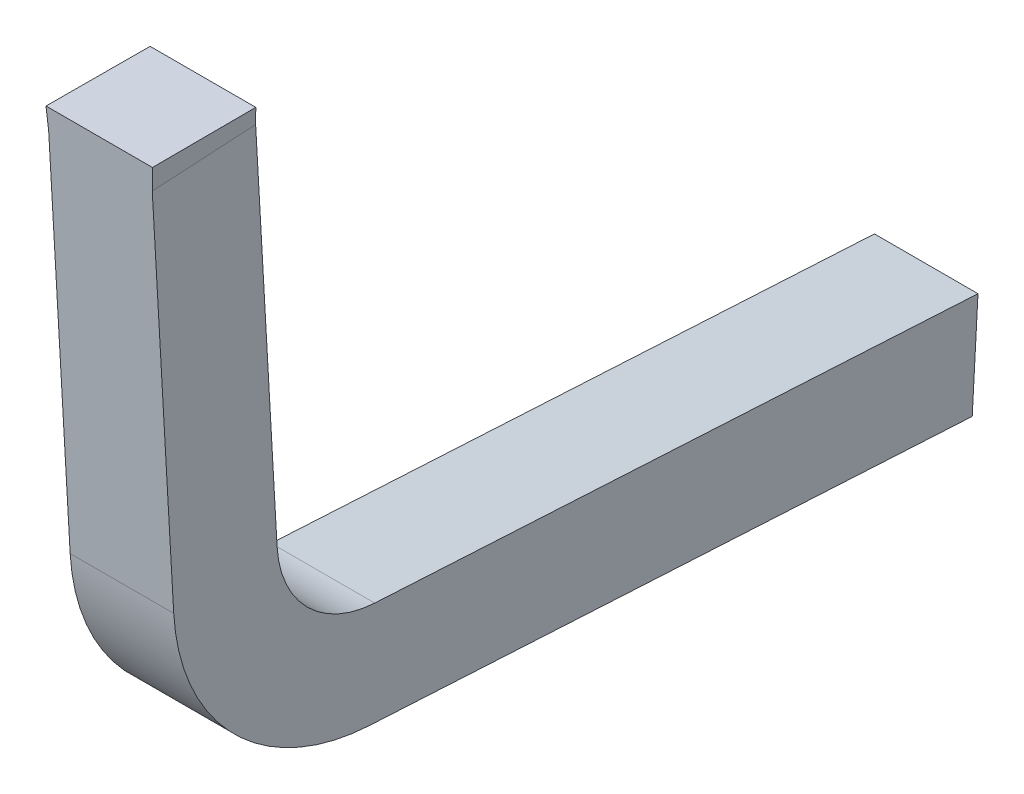
ISO-10303-21;
HEADER;
FILE_DESCRIPTION(('STEP AP214'),'2;1');
FILE_NAME('part.step','',(''),(''),'','','');
FILE_SCHEMA(('AUTOMOTIVE_DESIGN { 1 0 10303 214 1 1 1 1 }'));
ENDSEC;
DATA;
#1=APPLICATION_CONTEXT('core data for automotive mechanical design processes');
#2=APPLICATION_PROTOCOL_DEFINITION('international standard','automotive_design',2000,#1);
#3=PRODUCT_CONTEXT('',#1,'mechanical');
#4=PRODUCT('Part','Part','',(#3));
#5=PRODUCT_RELATED_PRODUCT_CATEGORY('part','',(#4));
#6=PRODUCT_DEFINITION_FORMATION('','',#4);
#7=PRODUCT_DEFINITION_CONTEXT('part definition',#1,'design');
#8=PRODUCT_DEFINITION('design','',#6,#7);
#9=PRODUCT_DEFINITION_SHAPE('','',#8);
#10=(LENGTH_UNIT() NAMED_UNIT(*) SI_UNIT(.MILLI.,.METRE.));
#11=(NAMED_UNIT(*) PLANE_ANGLE_UNIT() SI_UNIT($,.RADIAN.));
#12=(NAMED_UNIT(*) SI_UNIT($,.STERADIAN.) SOLID_ANGLE_UNIT());
#13=UNCERTAINTY_MEASURE_WITH_UNIT(LENGTH_MEASURE(1.E-05),#10,'distance_accuracy_value','');
#14=(GEOMETRIC_REPRESENTATION_CONTEXT(3) GLOBAL_UNCERTAINTY_ASSIGNED_CONTEXT((#13)) GLOBAL_UNIT_ASSIGNED_CONTEXT((#10,
#11,#12)) REPRESENTATION_CONTEXT('',''));
#15=CARTESIAN_POINT('',(0.,0.,0.));
#16=DIRECTION('',(0.,0.,1.));
#17=DIRECTION('',(1.,0.,0.));
#18=AXIS2_PLACEMENT_3D('',#15,#16,#17);
#19=CARTESIAN_POINT('',(0.3985931658174,-2.29897527843,-10.34781984343));
#20=DIRECTION('',(0.99778515785658,0.0664110879142587,0.00378763292365092));
#21=DIRECTION('',(-0.0664115642915359,0.997792315127928,0.));
#22=AXIS2_PLACEMENT_3D('',#19,#20,#21);
#23=PLANE('',#22);
#24=DIRECTION('',(0.,-0.0569406083110753,0.998377567418842));
#25=VECTOR('',#24,1.);
#26=CARTESIAN_POINT('',(0.4,-2.314349492935,-10.44885919008));
#27=LINE('',#26,#25);
#28=CARTESIAN_POINT('',(0.4,-2.31434949293492,-10.4488591900814));
#29=VERTEX_POINT('',#28);
#30=CARTESIAN_POINT('',(0.4,-2.32573761459727,-10.2491836765951));
#31=VERTEX_POINT('',#30);
#32=EDGE_CURVE('E98',#29,#31,#27,.T.);
#33=ORIENTED_EDGE('',*,*,#32,.T.);
#34=DIRECTION('',(0.0665190105194852,-0.996166318707669,-0.0568144938542911));
#35=VECTOR('',#34,1.);
#36=CARTESIAN_POINT('',(0.3971863316348,-2.28360106392498,-10.2467804967704));
#37=LINE('',#36,#35);
#38=CARTESIAN_POINT('',(0.3971863316348,-2.28360106392499,-10.2467804967704));
#39=VERTEX_POINT('',#38);
#40=EDGE_CURVE('E148',#39,#31,#37,.T.);
#41=ORIENTED_EDGE('',*,*,#40,.F.);
#42=DIRECTION('',(-0.003796013203572,0.,0.999992795115924));
#43=VECTOR('',#42,1.);
#44=CARTESIAN_POINT('',(0.3979467735112,-2.283601063925,-10.4471055106));
#45=LINE('',#44,#43);
#46=CARTESIAN_POINT('',(0.3979467735112,-2.28360106392489,-10.4471055106019));
#47=VERTEX_POINT('',#46);
#48=EDGE_CURVE('E161',#47,#39,#45,.T.);
#49=ORIENTED_EDGE('',*,*,#48,.F.);
#50=DIRECTION('',(0.0665190105209171,-0.996166318707655,-0.0568144938528551));
#51=VECTOR('',#50,1.);
#52=CARTESIAN_POINT('',(0.3979467735112,-2.28360106392483,-10.4471055106029));
#53=LINE('',#52,#51);
#54=EDGE_CURVE('E103',#47,#29,#53,.T.);
#55=ORIENTED_EDGE('',*,*,#54,.T.);
#56=EDGE_LOOP('',(#33,#41,#49,#55));
#57=FACE_BOUND('',#56,.T.);
#58=ADVANCED_FACE('F17',(#57),#23,.F.);
#59=CARTESIAN_POINT('',(0.5,-2.283601063925,-10.34694300369));
#60=DIRECTION('',(0.,1.,0.));
#61=DIRECTION('',(0.,0.,1.));
#62=AXIS2_PLACEMENT_3D('',#59,#60,#61);
#63=PLANE('',#62);
#64=DIRECTION('',(1.,0.,0.));
#65=VECTOR('',#64,1.);
#66=CARTESIAN_POINT('',(0.4999999999999,-2.28360106392498,-10.2467804967704));
#67=LINE('',#66,#65);
#68=CARTESIAN_POINT('',(0.602813668365201,-2.28360106392499,-10.2467804967704));
#69=VERTEX_POINT('',#68);
#70=EDGE_CURVE('E154',#69,#39,#67,.F.);
#71=ORIENTED_EDGE('',*,*,#70,.F.);
#72=DIRECTION('',(0.00379601320391404,0.,0.999992795115923));
#73=VECTOR('',#72,1.);
#74=CARTESIAN_POINT('',(0.602053226488737,-2.283601063925,-10.4471055106));
#75=LINE('',#74,#73);
#76=CARTESIAN_POINT('',(0.602053226488724,-2.28360106392495,-10.447105510601));
#77=VERTEX_POINT('',#76);
#78=EDGE_CURVE('E119',#77,#69,#75,.T.);
#79=ORIENTED_EDGE('',*,*,#78,.F.);
#80=DIRECTION('',(1.,0.,0.));
#81=VECTOR('',#80,1.);
#82=CARTESIAN_POINT('',(0.4999999999999,-2.28360106392483,-10.4471055106029));
#83=LINE('',#82,#81);
#84=EDGE_CURVE('E125',#77,#47,#83,.F.);
#85=ORIENTED_EDGE('',*,*,#84,.T.);
#86=ORIENTED_EDGE('',*,*,#48,.T.);
#87=EDGE_LOOP('',(#71,#79,#85,#86));
#88=FACE_BOUND('',#87,.T.);
#89=ADVANCED_FACE('F243',(#88),#63,.T.);
#90=CARTESIAN_POINT('',(0.4,-2.909472777839,-11.05227927458));
#91=DIRECTION('',(1.,0.,0.));
#92=DIRECTION('',(0.,0.,-1.));
#93=AXIS2_PLACEMENT_3D('',#90,#91,#92);
#94=PLANE('',#93);
#95=CARTESIAN_POINT('',(0.4,-3.03,-10.69));
#96=DIRECTION('',(-1.,0.,0.));
#97=DIRECTION('',(0.,0.,1.));
#98=AXIS2_PLACEMENT_3D('',#95,#96,#97);
#99=CIRCLE('',#98,0.4);
#100=CARTESIAN_POINT('',(0.4,-3.05277624331319,-10.2906489730306));
#101=VERTEX_POINT('',#100);
#102=CARTESIAN_POINT('',(0.4,-3.42937693582933,-10.6676826720305));
#103=VERTEX_POINT('',#102);
#104=EDGE_CURVE('E142',#101,#103,#99,.F.);
#105=ORIENTED_EDGE('',*,*,#104,.F.);
#106=DIRECTION('',(0.,-0.998377567418718,-0.056940608313261));
#107=VECTOR('',#106,1.);
#108=CARTESIAN_POINT('',(0.4,-2.668188653621,-10.2687147349));
#109=LINE('',#108,#107);
#110=EDGE_CURVE('E145',#31,#101,#109,.T.);
#111=ORIENTED_EDGE('',*,*,#110,.F.);
#112=ORIENTED_EDGE('',*,*,#32,.F.);
#113=DIRECTION('',(0.,-0.998377567418801,-0.0569406083117901));
#114=VECTOR('',#113,1.);
#115=CARTESIAN_POINT('',(0.4,-2.662494592804,-10.46871499856));
#116=LINE('',#115,#114);
#117=CARTESIAN_POINT('',(0.4,-3.04138812167726,-10.4903244865168));
#118=VERTEX_POINT('',#117);
#119=EDGE_CURVE('E92',#29,#118,#116,.T.);
#120=ORIENTED_EDGE('',*,*,#119,.T.);
#121=CARTESIAN_POINT('',(0.4,-3.03,-10.69));
#122=DIRECTION('',(-1.,0.,0.));
#123=DIRECTION('',(0.,0.,1.));
#124=AXIS2_PLACEMENT_3D('',#121,#122,#123);
#125=CIRCLE('',#124,0.2);
#126=CARTESIAN_POINT('',(0.4,-3.22968846791482,-10.6788413360177));
#127=VERTEX_POINT('',#126);
#128=EDGE_CURVE('E20',#118,#127,#125,.F.);
#129=ORIENTED_EDGE('',*,*,#128,.T.);
#130=DIRECTION('',(0.,0.0557933199228295,0.998442339572991));
#131=VECTOR('',#130,1.);
#132=CARTESIAN_POINT('',(0.4,-3.262244863925,-11.26145022621));
#133=LINE('',#132,#131);
#134=CARTESIAN_POINT('',(0.4,-3.29480125993501,-11.8440591164004));
#135=VERTEX_POINT('',#134);
#136=EDGE_CURVE('E111',#135,#127,#133,.T.);
#137=ORIENTED_EDGE('',*,*,#136,.F.);
#138=DIRECTION('',(0.,-0.998442339574031,0.0557933199042218));
#139=VECTOR('',#138,1.);
#140=CARTESIAN_POINT('',(0.4,-3.394645493892,-11.83847978441));
#141=LINE('',#140,#139);
#142=CARTESIAN_POINT('',(0.4,-3.49448972784906,-11.8329004524196));
#143=VERTEX_POINT('',#142);
#144=EDGE_CURVE('E135',#135,#143,#141,.T.);
#145=ORIENTED_EDGE('',*,*,#144,.T.);
#146=DIRECTION('',(0.,0.055793319922371,0.998442339573017));
#147=VECTOR('',#146,1.);
#148=CARTESIAN_POINT('',(0.4,-3.461933331839,-11.25029156222));
#149=LINE('',#148,#147);
#150=EDGE_CURVE('E140',#143,#103,#149,.T.);
#151=ORIENTED_EDGE('',*,*,#150,.T.);
#152=EDGE_LOOP('',(#105,#111,#112,#120,#129,#137,#145,#151));
#153=FACE_BOUND('',#152,.T.);
#154=ADVANCED_FACE('F95',(#153),#94,.F.);
#155=CARTESIAN_POINT('',(0.5,-3.262244863925,-11.26145022621));
#156=DIRECTION('',(0.,0.998442339572991,-0.0557933199228295));
#157=DIRECTION('',(0.,0.0557933199228295,0.998442339572991));
#158=AXIS2_PLACEMENT_3D('',#155,#156,#157);
#159=PLANE('',#158);
#160=DIRECTION('',(0.,0.055793319922887,0.998442339572988));
#161=VECTOR('',#160,1.);
#162=CARTESIAN_POINT('',(0.6,-3.294801259935,-11.8440591164));
#163=LINE('',#162,#161);
#164=CARTESIAN_POINT('',(0.6,-3.29480125993501,-11.8440591164001));
#165=VERTEX_POINT('',#164);
#166=CARTESIAN_POINT('',(0.6,-3.2296884679148,-10.6788413360177));
#167=VERTEX_POINT('',#166);
#168=EDGE_CURVE('E129',#165,#167,#163,.T.);
#169=ORIENTED_EDGE('',*,*,#168,.F.);
#170=DIRECTION('',(1.,0.,0.));
#171=VECTOR('',#170,1.);
#172=CARTESIAN_POINT('',(0.5,-3.29480125993502,-11.8440591164004));
#173=LINE('',#172,#171);
#174=EDGE_CURVE('E126',#165,#135,#173,.F.);
#175=ORIENTED_EDGE('',*,*,#174,.T.);
#176=ORIENTED_EDGE('',*,*,#136,.T.);
#177=DIRECTION('',(-1.,0.,0.));
#178=VECTOR('',#177,1.);
#179=CARTESIAN_POINT('',(0.604,-3.22968846791485,-10.67884133602));
#180=LINE('',#179,#178);
#181=EDGE_CURVE('E110',#127,#167,#180,.F.);
#182=ORIENTED_EDGE('',*,*,#181,.T.);
#183=EDGE_LOOP('',(#169,#175,#176,#182));
#184=FACE_BOUND('',#183,.T.);
#185=ADVANCED_FACE('F234',(#184),#159,.T.);
#186=CARTESIAN_POINT('',(0.604,-3.03,-10.69));
#187=DIRECTION('',(-1.,0.,0.));
#188=DIRECTION('',(0.,0.,1.));
#189=AXIS2_PLACEMENT_3D('',#186,#187,#188);
#190=CYLINDRICAL_SURFACE('',#189,0.2);
#191=ORIENTED_EDGE('',*,*,#128,.F.);
#192=DIRECTION('',(1.,0.,0.));
#193=VECTOR('',#192,1.);
#194=CARTESIAN_POINT('',(0.4999999999999,-3.04138812169214,-10.4903244865176));
#195=LINE('',#194,#193);
#196=CARTESIAN_POINT('',(0.6,-3.04138812167779,-10.490324486518));
#197=VERTEX_POINT('',#196);
#198=EDGE_CURVE('E102',#118,#197,#195,.T.);
#199=ORIENTED_EDGE('',*,*,#198,.T.);
#200=CARTESIAN_POINT('',(0.6,-3.03,-10.69));
#201=DIRECTION('',(-1.,0.,0.));
#202=DIRECTION('',(0.,0.,1.));
#203=AXIS2_PLACEMENT_3D('',#200,#201,#202);
#204=CIRCLE('',#203,0.2);
#205=EDGE_CURVE('E185',#167,#197,#204,.T.);
#206=ORIENTED_EDGE('',*,*,#205,.F.);
#207=ORIENTED_EDGE('',*,*,#181,.F.);
#208=EDGE_LOOP('',(#191,#199,#206,#207));
#209=FACE_BOUND('',#208,.T.);
#210=ADVANCED_FACE('F107',(#209),#190,.F.);
#211=CARTESIAN_POINT('',(0.4999999999999,-2.662494592804,-10.46871499856));
#212=DIRECTION('',(0.,-0.0569406083117901,0.998377567418801));
#213=DIRECTION('',(0.,-0.998377567418801,-0.0569406083117901));
#214=AXIS2_PLACEMENT_3D('',#211,#212,#213);
#215=PLANE('',#214);
#216=DIRECTION('',(0.,0.998377567418456,0.0569406083178453));
#217=VECTOR('',#216,1.);
#218=CARTESIAN_POINT('',(0.6,-3.041388121692,-10.49032448652));
#219=LINE('',#218,#217);
#220=CARTESIAN_POINT('',(0.599999999999989,-2.314349492934,-10.44885919008));
#221=VERTEX_POINT('',#220);
#222=EDGE_CURVE('E114',#197,#221,#219,.T.);
#223=ORIENTED_EDGE('',*,*,#222,.F.);
#224=ORIENTED_EDGE('',*,*,#198,.F.);
#225=ORIENTED_EDGE('',*,*,#119,.F.);
#226=ORIENTED_EDGE('',*,*,#54,.F.);
#227=ORIENTED_EDGE('',*,*,#84,.F.);
#228=DIRECTION('',(0.0665190105221076,0.99616631870597,0.0568144938810031));
#229=VECTOR('',#228,1.);
#230=CARTESIAN_POINT('',(0.599999999999967,-2.314349492934,-10.44885919008));
#231=LINE('',#230,#229);
#232=EDGE_CURVE('E116',#221,#77,#231,.T.);
#233=ORIENTED_EDGE('',*,*,#232,.F.);
#234=EDGE_LOOP('',(#223,#224,#225,#226,#227,#233));
#235=FACE_BOUND('',#234,.T.);
#236=ADVANCED_FACE('F112',(#235),#215,.F.);
#237=CARTESIAN_POINT('',(0.6014068341826,-2.298975278429,-10.34781984343));
#238=DIRECTION('',(0.99778515785672,-0.0664110879121713,-0.00378763292334907));
#239=DIRECTION('',(0.0664115642894485,0.997792315128067,0.));
#240=AXIS2_PLACEMENT_3D('',#237,#238,#239);
#241=PLANE('',#240);
#242=ORIENTED_EDGE('',*,*,#232,.T.);
#243=ORIENTED_EDGE('',*,*,#78,.T.);
#244=DIRECTION('',(0.0665190105226197,0.996166318707459,0.0568144938543015));
#245=VECTOR('',#244,1.);
#246=CARTESIAN_POINT('',(0.6,-2.32573761459528,-10.249183676595));
#247=LINE('',#246,#245);
#248=CARTESIAN_POINT('',(0.6,-2.32573761459509,-10.2491836765983));
#249=VERTEX_POINT('',#248);
#250=EDGE_CURVE('E147',#249,#69,#247,.T.);
#251=ORIENTED_EDGE('',*,*,#250,.F.);
#252=DIRECTION('',(0.,-0.0569406083060912,0.998377567419126));
#253=VECTOR('',#252,1.);
#254=CARTESIAN_POINT('',(0.6,-2.314349492934,-10.44885919008));
#255=LINE('',#254,#253);
#256=EDGE_CURVE('E200',#221,#249,#255,.T.);
#257=ORIENTED_EDGE('',*,*,#256,.F.);
#258=EDGE_LOOP('',(#242,#243,#251,#257));
#259=FACE_BOUND('',#258,.T.);
#260=ADVANCED_FACE('F258',(#259),#241,.T.);
#261=CARTESIAN_POINT('',(0.4999999999999,-2.668188653621,-10.2687147349));
#262=DIRECTION('',(0.,-0.056940608313261,0.998377567418718));
#263=DIRECTION('',(0.,-0.998377567418718,-0.056940608313261));
#264=AXIS2_PLACEMENT_3D('',#261,#262,#263);
#265=PLANE('',#264);
#266=ORIENTED_EDGE('',*,*,#250,.T.);
#267=ORIENTED_EDGE('',*,*,#70,.T.);
#268=ORIENTED_EDGE('',*,*,#40,.T.);
#269=ORIENTED_EDGE('',*,*,#110,.T.);
#270=DIRECTION('',(-1.,0.,0.));
#271=VECTOR('',#270,1.);
#272=CARTESIAN_POINT('',(0.604,-3.05277624330094,-10.2906489730311));
#273=LINE('',#272,#271);
#274=CARTESIAN_POINT('',(0.6,-3.05277624331214,-10.2906489730312));
#275=VERTEX_POINT('',#274);
#276=EDGE_CURVE('E157',#275,#101,#273,.T.);
#277=ORIENTED_EDGE('',*,*,#276,.F.);
#278=DIRECTION('',(0.,-0.998377567419005,-0.0569406083082185));
#279=VECTOR('',#278,1.);
#280=CARTESIAN_POINT('',(0.6,-2.325737614595,-10.2491836766));
#281=LINE('',#280,#279);
#282=EDGE_CURVE('E184',#249,#275,#281,.T.);
#283=ORIENTED_EDGE('',*,*,#282,.F.);
#284=EDGE_LOOP('',(#266,#267,#268,#269,#277,#283));
#285=FACE_BOUND('',#284,.T.);
#286=ADVANCED_FACE('F227',(#285),#265,.T.);
#287=CARTESIAN_POINT('',(0.604,-3.03,-10.69));
#288=DIRECTION('',(-1.,0.,0.));
#289=DIRECTION('',(0.,0.,1.));
#290=AXIS2_PLACEMENT_3D('',#287,#288,#289);
#291=CYLINDRICAL_SURFACE('',#290,0.4);
#292=DIRECTION('',(1.,0.,0.));
#293=VECTOR('',#292,1.);
#294=CARTESIAN_POINT('',(0.5,-3.4293769358293,-10.66768267203));
#295=LINE('',#294,#293);
#296=CARTESIAN_POINT('',(0.6,-3.42937693582946,-10.6676826720306));
#297=VERTEX_POINT('',#296);
#298=EDGE_CURVE('E137',#103,#297,#295,.T.);
#299=ORIENTED_EDGE('',*,*,#298,.T.);
#300=CARTESIAN_POINT('',(0.6,-3.03,-10.69));
#301=DIRECTION('',(-1.,0.,0.));
#302=DIRECTION('',(0.,0.,1.));
#303=AXIS2_PLACEMENT_3D('',#300,#301,#302);
#304=CIRCLE('',#303,0.4);
#305=EDGE_CURVE('E181',#275,#297,#304,.F.);
#306=ORIENTED_EDGE('',*,*,#305,.F.);
#307=ORIENTED_EDGE('',*,*,#276,.T.);
#308=ORIENTED_EDGE('',*,*,#104,.T.);
#309=EDGE_LOOP('',(#299,#306,#307,#308));
#310=FACE_BOUND('',#309,.T.);
#311=ADVANCED_FACE('F220',(#310),#291,.T.);
#312=CARTESIAN_POINT('',(0.5,-3.461933331839,-11.25029156222));
#313=DIRECTION('',(0.,0.998442339573017,-0.055793319922371));
#314=DIRECTION('',(0.,0.055793319922371,0.998442339573017));
#315=AXIS2_PLACEMENT_3D('',#312,#313,#314);
#316=PLANE('',#315);
#317=ORIENTED_EDGE('',*,*,#298,.F.);
#318=ORIENTED_EDGE('',*,*,#150,.F.);
#319=DIRECTION('',(1.,0.,0.));
#320=VECTOR('',#319,1.);
#321=CARTESIAN_POINT('',(0.5,-3.49448972784898,-11.8329004524196));
#322=LINE('',#321,#320);
#323=CARTESIAN_POINT('',(0.6,-3.49448972784899,-11.8329004524199));
#324=VERTEX_POINT('',#323);
#325=EDGE_CURVE('E35',#143,#324,#322,.T.);
#326=ORIENTED_EDGE('',*,*,#325,.T.);
#327=DIRECTION('',(0.,-0.0557933199219327,-0.998442339573042));
#328=VECTOR('',#327,1.);
#329=CARTESIAN_POINT('',(0.6,-3.429376935829,-10.66768267202));
#330=LINE('',#329,#328);
#331=EDGE_CURVE('E26',#297,#324,#330,.T.);
#332=ORIENTED_EDGE('',*,*,#331,.F.);
#333=EDGE_LOOP('',(#317,#318,#326,#332));
#334=FACE_BOUND('',#333,.T.);
#335=ADVANCED_FACE('F222',(#334),#316,.F.);
#336=CARTESIAN_POINT('',(0.5,-3.394645493892,-11.83847978441));
#337=DIRECTION('',(0.,0.0557933199042218,0.998442339574031));
#338=DIRECTION('',(0.,-0.998442339574031,0.0557933199042218));
#339=AXIS2_PLACEMENT_3D('',#336,#337,#338);
#340=PLANE('',#339);
#341=DIRECTION('',(0.,0.998442339574254,-0.0557933199002383));
#342=VECTOR('',#341,1.);
#343=CARTESIAN_POINT('',(0.6,-3.494489727849,-11.83290045242));
#344=LINE('',#343,#342);
#345=EDGE_CURVE('E11',#324,#165,#344,.T.);
#346=ORIENTED_EDGE('',*,*,#345,.F.);
#347=ORIENTED_EDGE('',*,*,#325,.F.);
#348=ORIENTED_EDGE('',*,*,#144,.F.);
#349=ORIENTED_EDGE('',*,*,#174,.F.);
#350=EDGE_LOOP('',(#346,#347,#348,#349));
#351=FACE_BOUND('',#350,.T.);
#352=ADVANCED_FACE('F230',(#351),#340,.F.);
#353=CARTESIAN_POINT('',(0.6,-2.909472777838,-11.05227927458));
#354=DIRECTION('',(1.,0.,0.));
#355=DIRECTION('',(0.,0.,-1.));
#356=AXIS2_PLACEMENT_3D('',#353,#354,#355);
#357=PLANE('',#356);
#358=ORIENTED_EDGE('',*,*,#331,.T.);
#359=ORIENTED_EDGE('',*,*,#345,.T.);
#360=ORIENTED_EDGE('',*,*,#168,.T.);
#361=ORIENTED_EDGE('',*,*,#205,.T.);
#362=ORIENTED_EDGE('',*,*,#222,.T.);
#363=ORIENTED_EDGE('',*,*,#256,.T.);
#364=ORIENTED_EDGE('',*,*,#282,.T.);
#365=ORIENTED_EDGE('',*,*,#305,.T.);
#366=EDGE_LOOP('',(#358,#359,#360,#361,#362,#363,#364,#365));
#367=FACE_BOUND('',#366,.T.);
#368=ADVANCED_FACE('F224',(#367),#357,.T.);
#369=CLOSED_SHELL('',(#58,#89,#154,#185,#210,#236,#260,#286,#311,#335,#352,#368));
#370=MANIFOLD_SOLID_BREP('B1',#369);
#371=ADVANCED_BREP_SHAPE_REPRESENTATION('',(#18,#370),#14);
#372=SHAPE_DEFINITION_REPRESENTATION(#9,#371);
ENDSEC;
END-ISO-10303-21;
